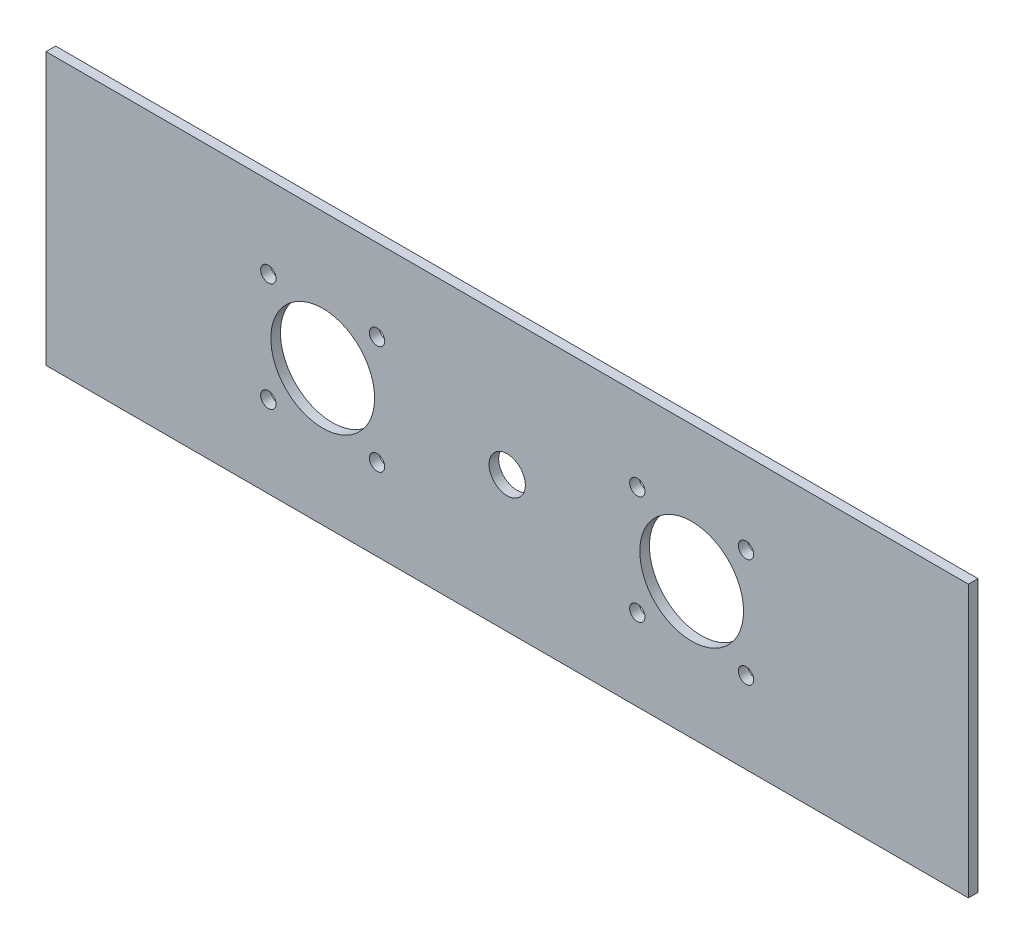
ISO-10303-21;
HEADER;
FILE_DESCRIPTION(('STEP AP214'),'2;1');
FILE_NAME('part.step','',(''),(''),'','','');
FILE_SCHEMA(('AUTOMOTIVE_DESIGN { 1 0 10303 214 1 1 1 1 }'));
ENDSEC;
DATA;
#1=APPLICATION_CONTEXT('core data for automotive mechanical design processes');
#2=APPLICATION_PROTOCOL_DEFINITION('international standard','automotive_design',2000,#1);
#3=PRODUCT_CONTEXT('',#1,'mechanical');
#4=PRODUCT('Part','Part','',(#3));
#5=PRODUCT_RELATED_PRODUCT_CATEGORY('part','',(#4));
#6=PRODUCT_DEFINITION_FORMATION('','',#4);
#7=PRODUCT_DEFINITION_CONTEXT('part definition',#1,'design');
#8=PRODUCT_DEFINITION('design','',#6,#7);
#9=PRODUCT_DEFINITION_SHAPE('','',#8);
#10=(LENGTH_UNIT() NAMED_UNIT(*) SI_UNIT(.MILLI.,.METRE.));
#11=(NAMED_UNIT(*) PLANE_ANGLE_UNIT() SI_UNIT($,.RADIAN.));
#12=(NAMED_UNIT(*) SI_UNIT($,.STERADIAN.) SOLID_ANGLE_UNIT());
#13=UNCERTAINTY_MEASURE_WITH_UNIT(LENGTH_MEASURE(1.E-05),#10,'distance_accuracy_value','');
#14=(GEOMETRIC_REPRESENTATION_CONTEXT(3) GLOBAL_UNCERTAINTY_ASSIGNED_CONTEXT((#13)) GLOBAL_UNIT_ASSIGNED_CONTEXT((#10,
#11,#12)) REPRESENTATION_CONTEXT('',''));
#15=CARTESIAN_POINT('',(0.,0.,0.));
#16=DIRECTION('',(0.,0.,1.));
#17=DIRECTION('',(1.,0.,0.));
#18=AXIS2_PLACEMENT_3D('',#15,#16,#17);
#19=CARTESIAN_POINT('',(0.,0.,3.175));
#20=DIRECTION('',(0.,0.,-1.));
#21=DIRECTION('',(-1.,0.,0.));
#22=AXIS2_PLACEMENT_3D('',#19,#20,#21);
#23=PLANE('',#22);
#24=DIRECTION('',(0.,-1.,0.));
#25=VECTOR('',#24,1.);
#26=CARTESIAN_POINT('',(0.,0.,3.175));
#27=LINE('',#26,#25);
#28=CARTESIAN_POINT('',(0.,89.8,3.175));
#29=VERTEX_POINT('',#28);
#30=CARTESIAN_POINT('',(0.,0.,3.175));
#31=VERTEX_POINT('',#30);
#32=EDGE_CURVE('E92',#29,#31,#27,.T.);
#33=ORIENTED_EDGE('',*,*,#32,.T.);
#34=DIRECTION('',(1.,0.,0.));
#35=VECTOR('',#34,1.);
#36=CARTESIAN_POINT('',(0.,0.,3.175));
#37=LINE('',#36,#35);
#38=CARTESIAN_POINT('',(304.8,0.,3.175));
#39=VERTEX_POINT('',#38);
#40=EDGE_CURVE('E87',#31,#39,#37,.T.);
#41=ORIENTED_EDGE('',*,*,#40,.T.);
#42=DIRECTION('',(0.,1.,0.));
#43=VECTOR('',#42,1.);
#44=CARTESIAN_POINT('',(304.8,0.,3.175));
#45=LINE('',#44,#43);
#46=CARTESIAN_POINT('',(304.8,89.8,3.175));
#47=VERTEX_POINT('',#46);
#48=EDGE_CURVE('E90',#39,#47,#45,.T.);
#49=ORIENTED_EDGE('',*,*,#48,.T.);
#50=DIRECTION('',(-1.,0.,0.));
#51=VECTOR('',#50,1.);
#52=CARTESIAN_POINT('',(0.,89.8,3.175));
#53=LINE('',#52,#51);
#54=EDGE_CURVE('E57',#47,#29,#53,.T.);
#55=ORIENTED_EDGE('',*,*,#54,.T.);
#56=EDGE_LOOP('',(#33,#41,#49,#55));
#57=FACE_BOUND('',#56,.T.);
#58=CARTESIAN_POINT('',(152.4,44.9,3.175));
#59=DIRECTION('',(0.,0.,1.));
#60=DIRECTION('',(1.,0.,0.));
#61=AXIS2_PLACEMENT_3D('',#58,#59,#60);
#62=CIRCLE('',#61,6.00000000000002);
#63=CARTESIAN_POINT('',(158.4,44.9,3.175));
#64=VERTEX_POINT('',#63);
#65=EDGE_CURVE('E112',#64,#64,#62,.T.);
#66=ORIENTED_EDGE('',*,*,#65,.F.);
#67=EDGE_LOOP('',(#66));
#68=FACE_BOUND('',#67,.T.);
#69=CARTESIAN_POINT('',(91.44,44.9,3.175));
#70=DIRECTION('',(0.,0.,1.));
#71=DIRECTION('',(1.,0.,0.));
#72=AXIS2_PLACEMENT_3D('',#69,#70,#71);
#73=CIRCLE('',#72,17.145);
#74=CARTESIAN_POINT('',(108.585,44.9,3.175));
#75=VERTEX_POINT('',#74);
#76=EDGE_CURVE('E134',#75,#75,#73,.T.);
#77=ORIENTED_EDGE('',*,*,#76,.F.);
#78=EDGE_LOOP('',(#77));
#79=FACE_BOUND('',#78,.T.);
#80=CARTESIAN_POINT('',(109.401585406358,62.8594390137919,3.175));
#81=DIRECTION('',(0.,0.,1.));
#82=DIRECTION('',(1.,0.,0.));
#83=AXIS2_PLACEMENT_3D('',#80,#81,#82);
#84=CIRCLE('',#83,2.54000000000001);
#85=CARTESIAN_POINT('',(111.941585406358,62.8594390137919,3.175));
#86=VERTEX_POINT('',#85);
#87=EDGE_CURVE('E142',#86,#86,#84,.T.);
#88=ORIENTED_EDGE('',*,*,#87,.F.);
#89=EDGE_LOOP('',(#88));
#90=FACE_BOUND('',#89,.T.);
#91=CARTESIAN_POINT('',(109.399439013792,26.938414593642,3.175));
#92=DIRECTION('',(0.,0.,1.));
#93=DIRECTION('',(1.,0.,0.));
#94=AXIS2_PLACEMENT_3D('',#91,#92,#93);
#95=CIRCLE('',#94,2.54);
#96=CARTESIAN_POINT('',(111.939439013792,26.938414593642,3.175));
#97=VERTEX_POINT('',#96);
#98=EDGE_CURVE('E150',#97,#97,#95,.T.);
#99=ORIENTED_EDGE('',*,*,#98,.F.);
#100=EDGE_LOOP('',(#99));
#101=FACE_BOUND('',#100,.T.);
#102=CARTESIAN_POINT('',(73.4784145936425,26.9405609862077,3.175));
#103=DIRECTION('',(0.,0.,1.));
#104=DIRECTION('',(1.,0.,0.));
#105=AXIS2_PLACEMENT_3D('',#102,#103,#104);
#106=CIRCLE('',#105,2.54000000000001);
#107=CARTESIAN_POINT('',(76.0184145936425,26.9405609862077,3.175));
#108=VERTEX_POINT('',#107);
#109=EDGE_CURVE('E158',#108,#108,#106,.T.);
#110=ORIENTED_EDGE('',*,*,#109,.F.);
#111=EDGE_LOOP('',(#110));
#112=FACE_BOUND('',#111,.T.);
#113=CARTESIAN_POINT('',(73.4805609862082,62.8615854063576,3.175));
#114=DIRECTION('',(0.,0.,1.));
#115=DIRECTION('',(1.,0.,0.));
#116=AXIS2_PLACEMENT_3D('',#113,#114,#115);
#117=CIRCLE('',#116,2.53999999999999);
#118=CARTESIAN_POINT('',(76.0205609862082,62.8615854063576,3.175));
#119=VERTEX_POINT('',#118);
#120=EDGE_CURVE('E166',#119,#119,#117,.T.);
#121=ORIENTED_EDGE('',*,*,#120,.F.);
#122=EDGE_LOOP('',(#121));
#123=FACE_BOUND('',#122,.T.);
#124=CARTESIAN_POINT('',(213.36,44.9,3.175));
#125=DIRECTION('',(0.,0.,1.));
#126=DIRECTION('',(1.,0.,0.));
#127=AXIS2_PLACEMENT_3D('',#124,#125,#126);
#128=CIRCLE('',#127,17.145);
#129=CARTESIAN_POINT('',(230.505,44.9,3.175));
#130=VERTEX_POINT('',#129);
#131=EDGE_CURVE('E174',#130,#130,#128,.T.);
#132=ORIENTED_EDGE('',*,*,#131,.F.);
#133=EDGE_LOOP('',(#132));
#134=FACE_BOUND('',#133,.T.);
#135=CARTESIAN_POINT('',(195.400560986209,62.8615854063583,3.175));
#136=DIRECTION('',(0.,0.,1.));
#137=DIRECTION('',(1.,0.,0.));
#138=AXIS2_PLACEMENT_3D('',#135,#136,#137);
#139=CIRCLE('',#138,2.54000000000004);
#140=CARTESIAN_POINT('',(197.940560986209,62.8615854063583,3.175));
#141=VERTEX_POINT('',#140);
#142=EDGE_CURVE('E182',#141,#141,#139,.T.);
#143=ORIENTED_EDGE('',*,*,#142,.F.);
#144=EDGE_LOOP('',(#143));
#145=FACE_BOUND('',#144,.T.);
#146=CARTESIAN_POINT('',(231.321585406358,62.8594390137919,3.175));
#147=DIRECTION('',(0.,0.,1.));
#148=DIRECTION('',(1.,0.,0.));
#149=AXIS2_PLACEMENT_3D('',#146,#147,#148);
#150=CIRCLE('',#149,2.54);
#151=CARTESIAN_POINT('',(233.861585406358,62.8594390137919,3.175));
#152=VERTEX_POINT('',#151);
#153=EDGE_CURVE('E190',#152,#152,#150,.T.);
#154=ORIENTED_EDGE('',*,*,#153,.F.);
#155=EDGE_LOOP('',(#154));
#156=FACE_BOUND('',#155,.T.);
#157=CARTESIAN_POINT('',(231.319439013792,26.938414593642,3.175));
#158=DIRECTION('',(0.,0.,1.));
#159=DIRECTION('',(1.,0.,0.));
#160=AXIS2_PLACEMENT_3D('',#157,#158,#159);
#161=CIRCLE('',#160,2.54000000000003);
#162=CARTESIAN_POINT('',(233.859439013792,26.938414593642,3.175));
#163=VERTEX_POINT('',#162);
#164=EDGE_CURVE('E198',#163,#163,#161,.T.);
#165=ORIENTED_EDGE('',*,*,#164,.F.);
#166=EDGE_LOOP('',(#165));
#167=FACE_BOUND('',#166,.T.);
#168=CARTESIAN_POINT('',(195.398414593642,26.9405609862087,3.175));
#169=DIRECTION('',(0.,0.,1.));
#170=DIRECTION('',(1.,0.,0.));
#171=AXIS2_PLACEMENT_3D('',#168,#169,#170);
#172=CIRCLE('',#171,2.54);
#173=CARTESIAN_POINT('',(197.938414593642,26.9405609862087,3.175));
#174=VERTEX_POINT('',#173);
#175=EDGE_CURVE('E206',#174,#174,#172,.T.);
#176=ORIENTED_EDGE('',*,*,#175,.F.);
#177=EDGE_LOOP('',(#176));
#178=FACE_BOUND('',#177,.T.);
#179=ADVANCED_FACE('F39',(#57,#68,#79,#90,#101,#112,#123,#134,#145,#156,#167,#178),#23,.F.);
#180=CARTESIAN_POINT('',(0.,0.,0.));
#181=DIRECTION('',(0.,0.,-1.));
#182=DIRECTION('',(-1.,0.,0.));
#183=AXIS2_PLACEMENT_3D('',#180,#181,#182);
#184=PLANE('',#183);
#185=CARTESIAN_POINT('',(231.319439013792,26.938414593642,0.));
#186=DIRECTION('',(0.,0.,1.));
#187=DIRECTION('',(1.,0.,0.));
#188=AXIS2_PLACEMENT_3D('',#185,#186,#187);
#189=CIRCLE('',#188,2.54000000000003);
#190=CARTESIAN_POINT('',(233.859439013792,26.938414593642,0.));
#191=VERTEX_POINT('',#190);
#192=EDGE_CURVE('E202',#191,#191,#189,.T.);
#193=ORIENTED_EDGE('',*,*,#192,.T.);
#194=EDGE_LOOP('',(#193));
#195=FACE_BOUND('',#194,.T.);
#196=CARTESIAN_POINT('',(195.400560986209,62.8615854063583,0.));
#197=DIRECTION('',(0.,0.,1.));
#198=DIRECTION('',(1.,0.,0.));
#199=AXIS2_PLACEMENT_3D('',#196,#197,#198);
#200=CIRCLE('',#199,2.54000000000004);
#201=CARTESIAN_POINT('',(197.940560986209,62.8615854063583,0.));
#202=VERTEX_POINT('',#201);
#203=EDGE_CURVE('E186',#202,#202,#200,.T.);
#204=ORIENTED_EDGE('',*,*,#203,.T.);
#205=EDGE_LOOP('',(#204));
#206=FACE_BOUND('',#205,.T.);
#207=CARTESIAN_POINT('',(73.4805609862082,62.8615854063576,0.));
#208=DIRECTION('',(0.,0.,1.));
#209=DIRECTION('',(1.,0.,0.));
#210=AXIS2_PLACEMENT_3D('',#207,#208,#209);
#211=CIRCLE('',#210,2.53999999999999);
#212=CARTESIAN_POINT('',(76.0205609862082,62.8615854063576,0.));
#213=VERTEX_POINT('',#212);
#214=EDGE_CURVE('E170',#213,#213,#211,.T.);
#215=ORIENTED_EDGE('',*,*,#214,.T.);
#216=EDGE_LOOP('',(#215));
#217=FACE_BOUND('',#216,.T.);
#218=CARTESIAN_POINT('',(109.399439013792,26.938414593642,0.));
#219=DIRECTION('',(0.,0.,1.));
#220=DIRECTION('',(1.,0.,0.));
#221=AXIS2_PLACEMENT_3D('',#218,#219,#220);
#222=CIRCLE('',#221,2.54);
#223=CARTESIAN_POINT('',(111.939439013792,26.938414593642,0.));
#224=VERTEX_POINT('',#223);
#225=EDGE_CURVE('E154',#224,#224,#222,.T.);
#226=ORIENTED_EDGE('',*,*,#225,.T.);
#227=EDGE_LOOP('',(#226));
#228=FACE_BOUND('',#227,.T.);
#229=CARTESIAN_POINT('',(91.44,44.9,0.));
#230=DIRECTION('',(0.,0.,1.));
#231=DIRECTION('',(1.,0.,0.));
#232=AXIS2_PLACEMENT_3D('',#229,#230,#231);
#233=CIRCLE('',#232,17.145);
#234=CARTESIAN_POINT('',(108.585,44.9,0.));
#235=VERTEX_POINT('',#234);
#236=EDGE_CURVE('E138',#235,#235,#233,.T.);
#237=ORIENTED_EDGE('',*,*,#236,.T.);
#238=EDGE_LOOP('',(#237));
#239=FACE_BOUND('',#238,.T.);
#240=DIRECTION('',(0.,-1.,0.));
#241=VECTOR('',#240,1.);
#242=CARTESIAN_POINT('',(0.,0.,0.));
#243=LINE('',#242,#241);
#244=CARTESIAN_POINT('',(0.,89.8,0.));
#245=VERTEX_POINT('',#244);
#246=CARTESIAN_POINT('',(0.,0.,0.));
#247=VERTEX_POINT('',#246);
#248=EDGE_CURVE('E108',#245,#247,#243,.T.);
#249=ORIENTED_EDGE('',*,*,#248,.F.);
#250=DIRECTION('',(-1.,0.,0.));
#251=VECTOR('',#250,1.);
#252=CARTESIAN_POINT('',(0.,89.8,0.));
#253=LINE('',#252,#251);
#254=CARTESIAN_POINT('',(304.8,89.8,0.));
#255=VERTEX_POINT('',#254);
#256=EDGE_CURVE('E80',#255,#245,#253,.T.);
#257=ORIENTED_EDGE('',*,*,#256,.F.);
#258=DIRECTION('',(0.,1.,0.));
#259=VECTOR('',#258,1.);
#260=CARTESIAN_POINT('',(304.8,0.,0.));
#261=LINE('',#260,#259);
#262=CARTESIAN_POINT('',(304.8,0.,0.));
#263=VERTEX_POINT('',#262);
#264=EDGE_CURVE('E74',#263,#255,#261,.T.);
#265=ORIENTED_EDGE('',*,*,#264,.F.);
#266=DIRECTION('',(1.,0.,0.));
#267=VECTOR('',#266,1.);
#268=CARTESIAN_POINT('',(0.,0.,0.));
#269=LINE('',#268,#267);
#270=EDGE_CURVE('E97',#247,#263,#269,.T.);
#271=ORIENTED_EDGE('',*,*,#270,.F.);
#272=EDGE_LOOP('',(#249,#257,#265,#271));
#273=FACE_BOUND('',#272,.T.);
#274=CARTESIAN_POINT('',(152.4,44.9,0.));
#275=DIRECTION('',(0.,0.,1.));
#276=DIRECTION('',(1.,0.,0.));
#277=AXIS2_PLACEMENT_3D('',#274,#275,#276);
#278=CIRCLE('',#277,6.00000000000002);
#279=CARTESIAN_POINT('',(158.4,44.9,0.));
#280=VERTEX_POINT('',#279);
#281=EDGE_CURVE('E130',#280,#280,#278,.T.);
#282=ORIENTED_EDGE('',*,*,#281,.T.);
#283=EDGE_LOOP('',(#282));
#284=FACE_BOUND('',#283,.T.);
#285=CARTESIAN_POINT('',(109.401585406358,62.8594390137919,0.));
#286=DIRECTION('',(0.,0.,1.));
#287=DIRECTION('',(1.,0.,0.));
#288=AXIS2_PLACEMENT_3D('',#285,#286,#287);
#289=CIRCLE('',#288,2.54000000000001);
#290=CARTESIAN_POINT('',(111.941585406358,62.8594390137919,0.));
#291=VERTEX_POINT('',#290);
#292=EDGE_CURVE('E146',#291,#291,#289,.T.);
#293=ORIENTED_EDGE('',*,*,#292,.T.);
#294=EDGE_LOOP('',(#293));
#295=FACE_BOUND('',#294,.T.);
#296=CARTESIAN_POINT('',(73.4784145936425,26.9405609862077,0.));
#297=DIRECTION('',(0.,0.,1.));
#298=DIRECTION('',(1.,0.,0.));
#299=AXIS2_PLACEMENT_3D('',#296,#297,#298);
#300=CIRCLE('',#299,2.54000000000001);
#301=CARTESIAN_POINT('',(76.0184145936425,26.9405609862077,0.));
#302=VERTEX_POINT('',#301);
#303=EDGE_CURVE('E162',#302,#302,#300,.T.);
#304=ORIENTED_EDGE('',*,*,#303,.T.);
#305=EDGE_LOOP('',(#304));
#306=FACE_BOUND('',#305,.T.);
#307=CARTESIAN_POINT('',(213.36,44.9,0.));
#308=DIRECTION('',(0.,0.,1.));
#309=DIRECTION('',(1.,0.,0.));
#310=AXIS2_PLACEMENT_3D('',#307,#308,#309);
#311=CIRCLE('',#310,17.145);
#312=CARTESIAN_POINT('',(230.505,44.9,0.));
#313=VERTEX_POINT('',#312);
#314=EDGE_CURVE('E178',#313,#313,#311,.T.);
#315=ORIENTED_EDGE('',*,*,#314,.T.);
#316=EDGE_LOOP('',(#315));
#317=FACE_BOUND('',#316,.T.);
#318=CARTESIAN_POINT('',(231.321585406358,62.8594390137919,0.));
#319=DIRECTION('',(0.,0.,1.));
#320=DIRECTION('',(1.,0.,0.));
#321=AXIS2_PLACEMENT_3D('',#318,#319,#320);
#322=CIRCLE('',#321,2.54);
#323=CARTESIAN_POINT('',(233.861585406358,62.8594390137919,0.));
#324=VERTEX_POINT('',#323);
#325=EDGE_CURVE('E194',#324,#324,#322,.T.);
#326=ORIENTED_EDGE('',*,*,#325,.T.);
#327=EDGE_LOOP('',(#326));
#328=FACE_BOUND('',#327,.T.);
#329=CARTESIAN_POINT('',(195.398414593642,26.9405609862087,0.));
#330=DIRECTION('',(0.,0.,1.));
#331=DIRECTION('',(1.,0.,0.));
#332=AXIS2_PLACEMENT_3D('',#329,#330,#331);
#333=CIRCLE('',#332,2.54);
#334=CARTESIAN_POINT('',(197.938414593642,26.9405609862087,0.));
#335=VERTEX_POINT('',#334);
#336=EDGE_CURVE('E210',#335,#335,#333,.T.);
#337=ORIENTED_EDGE('',*,*,#336,.T.);
#338=EDGE_LOOP('',(#337));
#339=FACE_BOUND('',#338,.T.);
#340=ADVANCED_FACE('F125',(#195,#206,#217,#228,#239,#273,#284,#295,#306,#317,#328,#339),#184,.T.);
#341=CARTESIAN_POINT('',(0.,0.,3.175));
#342=DIRECTION('',(1.,0.,0.));
#343=DIRECTION('',(0.,0.,-1.));
#344=AXIS2_PLACEMENT_3D('',#341,#342,#343);
#345=PLANE('',#344);
#346=ORIENTED_EDGE('',*,*,#248,.T.);
#347=DIRECTION('',(0.,0.,-1.));
#348=VECTOR('',#347,1.);
#349=CARTESIAN_POINT('',(0.,0.,3.175));
#350=LINE('',#349,#348);
#351=EDGE_CURVE('E11',#31,#247,#350,.T.);
#352=ORIENTED_EDGE('',*,*,#351,.F.);
#353=ORIENTED_EDGE('',*,*,#32,.F.);
#354=DIRECTION('',(0.,0.,-1.));
#355=VECTOR('',#354,1.);
#356=CARTESIAN_POINT('',(0.,89.8,3.175));
#357=LINE('',#356,#355);
#358=EDGE_CURVE('E104',#29,#245,#357,.T.);
#359=ORIENTED_EDGE('',*,*,#358,.T.);
#360=EDGE_LOOP('',(#346,#352,#353,#359));
#361=FACE_BOUND('',#360,.T.);
#362=ADVANCED_FACE('F41',(#361),#345,.F.);
#363=CARTESIAN_POINT('',(0.,0.,3.175));
#364=DIRECTION('',(0.,1.,0.));
#365=DIRECTION('',(0.,0.,1.));
#366=AXIS2_PLACEMENT_3D('',#363,#364,#365);
#367=PLANE('',#366);
#368=ORIENTED_EDGE('',*,*,#270,.T.);
#369=DIRECTION('',(0.,0.,-1.));
#370=VECTOR('',#369,1.);
#371=CARTESIAN_POINT('',(304.8,0.,3.175));
#372=LINE('',#371,#370);
#373=EDGE_CURVE('E49',#39,#263,#372,.T.);
#374=ORIENTED_EDGE('',*,*,#373,.F.);
#375=ORIENTED_EDGE('',*,*,#40,.F.);
#376=ORIENTED_EDGE('',*,*,#351,.T.);
#377=EDGE_LOOP('',(#368,#374,#375,#376));
#378=FACE_BOUND('',#377,.T.);
#379=ADVANCED_FACE('F96',(#378),#367,.F.);
#380=CARTESIAN_POINT('',(304.8,0.,3.175));
#381=DIRECTION('',(-1.,0.,0.));
#382=DIRECTION('',(0.,0.,1.));
#383=AXIS2_PLACEMENT_3D('',#380,#381,#382);
#384=PLANE('',#383);
#385=ORIENTED_EDGE('',*,*,#264,.T.);
#386=DIRECTION('',(0.,0.,-1.));
#387=VECTOR('',#386,1.);
#388=CARTESIAN_POINT('',(304.8,89.8,3.175));
#389=LINE('',#388,#387);
#390=EDGE_CURVE('E99',#47,#255,#389,.T.);
#391=ORIENTED_EDGE('',*,*,#390,.F.);
#392=ORIENTED_EDGE('',*,*,#48,.F.);
#393=ORIENTED_EDGE('',*,*,#373,.T.);
#394=EDGE_LOOP('',(#385,#391,#392,#393));
#395=FACE_BOUND('',#394,.T.);
#396=ADVANCED_FACE('F100',(#395),#384,.F.);
#397=CARTESIAN_POINT('',(0.,89.8,3.175));
#398=DIRECTION('',(0.,-1.,0.));
#399=DIRECTION('',(0.,0.,-1.));
#400=AXIS2_PLACEMENT_3D('',#397,#398,#399);
#401=PLANE('',#400);
#402=ORIENTED_EDGE('',*,*,#256,.T.);
#403=ORIENTED_EDGE('',*,*,#358,.F.);
#404=ORIENTED_EDGE('',*,*,#54,.F.);
#405=ORIENTED_EDGE('',*,*,#390,.T.);
#406=EDGE_LOOP('',(#402,#403,#404,#405));
#407=FACE_BOUND('',#406,.T.);
#408=ADVANCED_FACE('F122',(#407),#401,.F.);
#409=CARTESIAN_POINT('',(152.4,44.9,3.175));
#410=DIRECTION('',(0.,0.,-1.));
#411=DIRECTION('',(-1.,0.,0.));
#412=AXIS2_PLACEMENT_3D('',#409,#410,#411);
#413=CYLINDRICAL_SURFACE('',#412,6.00000000000002);
#414=ORIENTED_EDGE('',*,*,#65,.T.);
#415=EDGE_LOOP('',(#414));
#416=FACE_BOUND('',#415,.T.);
#417=ORIENTED_EDGE('',*,*,#281,.F.);
#418=EDGE_LOOP('',(#417));
#419=FACE_BOUND('',#418,.T.);
#420=ADVANCED_FACE('F229',(#416,#419),#413,.F.);
#421=CARTESIAN_POINT('',(91.44,44.9,3.175));
#422=DIRECTION('',(0.,0.,-1.));
#423=DIRECTION('',(-1.,0.,0.));
#424=AXIS2_PLACEMENT_3D('',#421,#422,#423);
#425=CYLINDRICAL_SURFACE('',#424,17.145);
#426=ORIENTED_EDGE('',*,*,#76,.T.);
#427=EDGE_LOOP('',(#426));
#428=FACE_BOUND('',#427,.T.);
#429=ORIENTED_EDGE('',*,*,#236,.F.);
#430=EDGE_LOOP('',(#429));
#431=FACE_BOUND('',#430,.T.);
#432=ADVANCED_FACE('F275',(#428,#431),#425,.F.);
#433=CARTESIAN_POINT('',(109.401585406358,62.8594390137919,3.175));
#434=DIRECTION('',(0.,0.,-1.));
#435=DIRECTION('',(-1.,0.,0.));
#436=AXIS2_PLACEMENT_3D('',#433,#434,#435);
#437=CYLINDRICAL_SURFACE('',#436,2.54000000000001);
#438=ORIENTED_EDGE('',*,*,#87,.T.);
#439=EDGE_LOOP('',(#438));
#440=FACE_BOUND('',#439,.T.);
#441=ORIENTED_EDGE('',*,*,#292,.F.);
#442=EDGE_LOOP('',(#441));
#443=FACE_BOUND('',#442,.T.);
#444=ADVANCED_FACE('F283',(#440,#443),#437,.F.);
#445=CARTESIAN_POINT('',(109.399439013792,26.938414593642,3.175));
#446=DIRECTION('',(0.,0.,-1.));
#447=DIRECTION('',(-1.,0.,0.));
#448=AXIS2_PLACEMENT_3D('',#445,#446,#447);
#449=CYLINDRICAL_SURFACE('',#448,2.54);
#450=ORIENTED_EDGE('',*,*,#98,.T.);
#451=EDGE_LOOP('',(#450));
#452=FACE_BOUND('',#451,.T.);
#453=ORIENTED_EDGE('',*,*,#225,.F.);
#454=EDGE_LOOP('',(#453));
#455=FACE_BOUND('',#454,.T.);
#456=ADVANCED_FACE('F291',(#452,#455),#449,.F.);
#457=CARTESIAN_POINT('',(73.4784145936425,26.9405609862077,3.175));
#458=DIRECTION('',(0.,0.,-1.));
#459=DIRECTION('',(-1.,0.,0.));
#460=AXIS2_PLACEMENT_3D('',#457,#458,#459);
#461=CYLINDRICAL_SURFACE('',#460,2.54000000000001);
#462=ORIENTED_EDGE('',*,*,#109,.T.);
#463=EDGE_LOOP('',(#462));
#464=FACE_BOUND('',#463,.T.);
#465=ORIENTED_EDGE('',*,*,#303,.F.);
#466=EDGE_LOOP('',(#465));
#467=FACE_BOUND('',#466,.T.);
#468=ADVANCED_FACE('F300',(#464,#467),#461,.F.);
#469=CARTESIAN_POINT('',(73.4805609862082,62.8615854063576,3.175));
#470=DIRECTION('',(0.,0.,-1.));
#471=DIRECTION('',(-1.,0.,0.));
#472=AXIS2_PLACEMENT_3D('',#469,#470,#471);
#473=CYLINDRICAL_SURFACE('',#472,2.53999999999999);
#474=ORIENTED_EDGE('',*,*,#120,.T.);
#475=EDGE_LOOP('',(#474));
#476=FACE_BOUND('',#475,.T.);
#477=ORIENTED_EDGE('',*,*,#214,.F.);
#478=EDGE_LOOP('',(#477));
#479=FACE_BOUND('',#478,.T.);
#480=ADVANCED_FACE('F309',(#476,#479),#473,.F.);
#481=CARTESIAN_POINT('',(213.36,44.9,3.175));
#482=DIRECTION('',(0.,0.,-1.));
#483=DIRECTION('',(-1.,0.,0.));
#484=AXIS2_PLACEMENT_3D('',#481,#482,#483);
#485=CYLINDRICAL_SURFACE('',#484,17.145);
#486=ORIENTED_EDGE('',*,*,#131,.T.);
#487=EDGE_LOOP('',(#486));
#488=FACE_BOUND('',#487,.T.);
#489=ORIENTED_EDGE('',*,*,#314,.F.);
#490=EDGE_LOOP('',(#489));
#491=FACE_BOUND('',#490,.T.);
#492=ADVANCED_FACE('F318',(#488,#491),#485,.F.);
#493=CARTESIAN_POINT('',(195.400560986209,62.8615854063583,3.175));
#494=DIRECTION('',(0.,0.,-1.));
#495=DIRECTION('',(-1.,0.,0.));
#496=AXIS2_PLACEMENT_3D('',#493,#494,#495);
#497=CYLINDRICAL_SURFACE('',#496,2.54000000000004);
#498=ORIENTED_EDGE('',*,*,#142,.T.);
#499=EDGE_LOOP('',(#498));
#500=FACE_BOUND('',#499,.T.);
#501=ORIENTED_EDGE('',*,*,#203,.F.);
#502=EDGE_LOOP('',(#501));
#503=FACE_BOUND('',#502,.T.);
#504=ADVANCED_FACE('F327',(#500,#503),#497,.F.);
#505=CARTESIAN_POINT('',(231.321585406358,62.8594390137919,3.175));
#506=DIRECTION('',(0.,0.,-1.));
#507=DIRECTION('',(-1.,0.,0.));
#508=AXIS2_PLACEMENT_3D('',#505,#506,#507);
#509=CYLINDRICAL_SURFACE('',#508,2.54);
#510=ORIENTED_EDGE('',*,*,#153,.T.);
#511=EDGE_LOOP('',(#510));
#512=FACE_BOUND('',#511,.T.);
#513=ORIENTED_EDGE('',*,*,#325,.F.);
#514=EDGE_LOOP('',(#513));
#515=FACE_BOUND('',#514,.T.);
#516=ADVANCED_FACE('F336',(#512,#515),#509,.F.);
#517=CARTESIAN_POINT('',(231.319439013792,26.938414593642,3.175));
#518=DIRECTION('',(0.,0.,-1.));
#519=DIRECTION('',(-1.,0.,0.));
#520=AXIS2_PLACEMENT_3D('',#517,#518,#519);
#521=CYLINDRICAL_SURFACE('',#520,2.54000000000003);
#522=ORIENTED_EDGE('',*,*,#164,.T.);
#523=EDGE_LOOP('',(#522));
#524=FACE_BOUND('',#523,.T.);
#525=ORIENTED_EDGE('',*,*,#192,.F.);
#526=EDGE_LOOP('',(#525));
#527=FACE_BOUND('',#526,.T.);
#528=ADVANCED_FACE('F345',(#524,#527),#521,.F.);
#529=CARTESIAN_POINT('',(195.398414593642,26.9405609862087,3.175));
#530=DIRECTION('',(0.,0.,-1.));
#531=DIRECTION('',(-1.,0.,0.));
#532=AXIS2_PLACEMENT_3D('',#529,#530,#531);
#533=CYLINDRICAL_SURFACE('',#532,2.54);
#534=ORIENTED_EDGE('',*,*,#175,.T.);
#535=EDGE_LOOP('',(#534));
#536=FACE_BOUND('',#535,.T.);
#537=ORIENTED_EDGE('',*,*,#336,.F.);
#538=EDGE_LOOP('',(#537));
#539=FACE_BOUND('',#538,.T.);
#540=ADVANCED_FACE('F218',(#536,#539),#533,.F.);
#541=CLOSED_SHELL('',(#179,#340,#362,#379,#396,#408,#420,#432,#444,#456,#468,#480,#492,#504,
#516,#528,#540));
#542=MANIFOLD_SOLID_BREP('B2',#541);
#543=ADVANCED_BREP_SHAPE_REPRESENTATION('',(#18,#542),#14);
#544=SHAPE_DEFINITION_REPRESENTATION(#9,#543);
ENDSEC;
END-ISO-10303-21;
